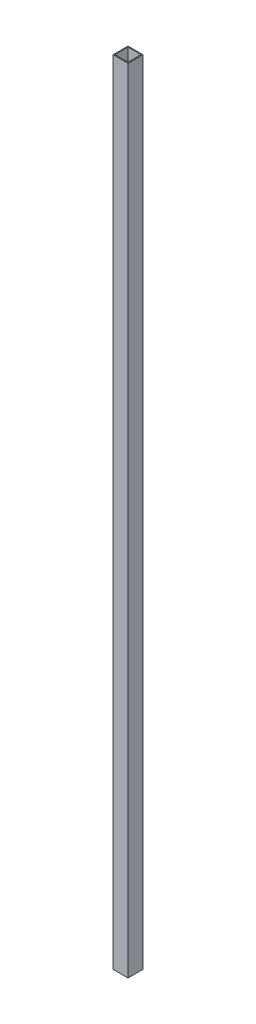
ISO-10303-21;
HEADER;
FILE_DESCRIPTION(('STEP AP214'),'2;1');
FILE_NAME('part.step','',(''),(''),'','','');
FILE_SCHEMA(('AUTOMOTIVE_DESIGN { 1 0 10303 214 1 1 1 1 }'));
ENDSEC;
DATA;
#1=APPLICATION_CONTEXT('core data for automotive mechanical design processes');
#2=APPLICATION_PROTOCOL_DEFINITION('international standard','automotive_design',2000,#1);
#3=PRODUCT_CONTEXT('',#1,'mechanical');
#4=PRODUCT('Part','Part','',(#3));
#5=PRODUCT_RELATED_PRODUCT_CATEGORY('part','',(#4));
#6=PRODUCT_DEFINITION_FORMATION('','',#4);
#7=PRODUCT_DEFINITION_CONTEXT('part definition',#1,'design');
#8=PRODUCT_DEFINITION('design','',#6,#7);
#9=PRODUCT_DEFINITION_SHAPE('','',#8);
#10=(LENGTH_UNIT() NAMED_UNIT(*) SI_UNIT(.MILLI.,.METRE.));
#11=(NAMED_UNIT(*) PLANE_ANGLE_UNIT() SI_UNIT($,.RADIAN.));
#12=(NAMED_UNIT(*) SI_UNIT($,.STERADIAN.) SOLID_ANGLE_UNIT());
#13=UNCERTAINTY_MEASURE_WITH_UNIT(LENGTH_MEASURE(1.E-05),#10,'distance_accuracy_value','');
#14=(GEOMETRIC_REPRESENTATION_CONTEXT(3) GLOBAL_UNCERTAINTY_ASSIGNED_CONTEXT((#13)) GLOBAL_UNIT_ASSIGNED_CONTEXT((#10,
#11,#12)) REPRESENTATION_CONTEXT('',''));
#15=CARTESIAN_POINT('',(0.,0.,0.));
#16=DIRECTION('',(0.,0.,1.));
#17=DIRECTION('',(1.,0.,0.));
#18=AXIS2_PLACEMENT_3D('',#15,#16,#17);
#19=CARTESIAN_POINT('',(0.,793.015,0.));
#20=DIRECTION('',(0.,1.,0.));
#21=DIRECTION('',(0.,0.,1.));
#22=AXIS2_PLACEMENT_3D('',#19,#20,#21);
#23=PLANE('',#22);
#24=DIRECTION('',(0.,0.,-1.));
#25=VECTOR('',#24,1.);
#26=CARTESIAN_POINT('',(15.,793.015,-15.));
#27=LINE('',#26,#25);
#28=CARTESIAN_POINT('',(15.,793.015,15.));
#29=VERTEX_POINT('',#28);
#30=CARTESIAN_POINT('',(15.,793.015,-15.));
#31=VERTEX_POINT('',#30);
#32=EDGE_CURVE('E153',#29,#31,#27,.T.);
#33=ORIENTED_EDGE('',*,*,#32,.T.);
#34=DIRECTION('',(-1.,0.,0.));
#35=VECTOR('',#34,1.);
#36=CARTESIAN_POINT('',(-15.,793.015,-15.));
#37=LINE('',#36,#35);
#38=CARTESIAN_POINT('',(-15.,793.015,-15.));
#39=VERTEX_POINT('',#38);
#40=EDGE_CURVE('E157',#31,#39,#37,.T.);
#41=ORIENTED_EDGE('',*,*,#40,.T.);
#42=DIRECTION('',(0.,0.,1.));
#43=VECTOR('',#42,1.);
#44=CARTESIAN_POINT('',(-15.,793.015,-15.));
#45=LINE('',#44,#43);
#46=CARTESIAN_POINT('',(-15.,793.015,15.));
#47=VERTEX_POINT('',#46);
#48=EDGE_CURVE('E161',#39,#47,#45,.T.);
#49=ORIENTED_EDGE('',*,*,#48,.T.);
#50=DIRECTION('',(1.,0.,0.));
#51=VECTOR('',#50,1.);
#52=CARTESIAN_POINT('',(-15.,793.015,15.));
#53=LINE('',#52,#51);
#54=EDGE_CURVE('E164',#47,#29,#53,.T.);
#55=ORIENTED_EDGE('',*,*,#54,.T.);
#56=EDGE_LOOP('',(#33,#41,#49,#55));
#57=FACE_BOUND('',#56,.T.);
#58=DIRECTION('',(0.,0.,1.));
#59=VECTOR('',#58,1.);
#60=CARTESIAN_POINT('',(-13.,793.015,-13.));
#61=LINE('',#60,#59);
#62=CARTESIAN_POINT('',(-13.,793.015,-13.));
#63=VERTEX_POINT('',#62);
#64=CARTESIAN_POINT('',(-13.,793.015,13.));
#65=VERTEX_POINT('',#64);
#66=EDGE_CURVE('E114',#63,#65,#61,.T.);
#67=ORIENTED_EDGE('',*,*,#66,.F.);
#68=DIRECTION('',(-1.,0.,0.));
#69=VECTOR('',#68,1.);
#70=CARTESIAN_POINT('',(-13.,793.015,-13.));
#71=LINE('',#70,#69);
#72=CARTESIAN_POINT('',(13.,793.015,-13.));
#73=VERTEX_POINT('',#72);
#74=EDGE_CURVE('E105',#73,#63,#71,.T.);
#75=ORIENTED_EDGE('',*,*,#74,.F.);
#76=DIRECTION('',(0.,0.,-1.));
#77=VECTOR('',#76,1.);
#78=CARTESIAN_POINT('',(13.,793.015,-13.));
#79=LINE('',#78,#77);
#80=CARTESIAN_POINT('',(13.,793.015,13.));
#81=VERTEX_POINT('',#80);
#82=EDGE_CURVE('E131',#81,#73,#79,.T.);
#83=ORIENTED_EDGE('',*,*,#82,.F.);
#84=DIRECTION('',(1.,0.,0.));
#85=VECTOR('',#84,1.);
#86=CARTESIAN_POINT('',(-13.,793.015,13.));
#87=LINE('',#86,#85);
#88=EDGE_CURVE('E127',#65,#81,#87,.T.);
#89=ORIENTED_EDGE('',*,*,#88,.F.);
#90=EDGE_LOOP('',(#67,#75,#83,#89));
#91=FACE_BOUND('',#90,.T.);
#92=ADVANCED_FACE('F39',(#57,#91),#23,.T.);
#93=CARTESIAN_POINT('',(0.,-793.015,0.));
#94=DIRECTION('',(0.,1.,0.));
#95=DIRECTION('',(0.,0.,1.));
#96=AXIS2_PLACEMENT_3D('',#93,#94,#95);
#97=PLANE('',#96);
#98=DIRECTION('',(0.,0.,-1.));
#99=VECTOR('',#98,1.);
#100=CARTESIAN_POINT('',(15.,-793.015,-15.));
#101=LINE('',#100,#99);
#102=CARTESIAN_POINT('',(15.,-793.015,15.));
#103=VERTEX_POINT('',#102);
#104=CARTESIAN_POINT('',(15.,-793.015,-15.));
#105=VERTEX_POINT('',#104);
#106=EDGE_CURVE('E123',#103,#105,#101,.T.);
#107=ORIENTED_EDGE('',*,*,#106,.F.);
#108=DIRECTION('',(1.,0.,0.));
#109=VECTOR('',#108,1.);
#110=CARTESIAN_POINT('',(-15.,-793.015,15.));
#111=LINE('',#110,#109);
#112=CARTESIAN_POINT('',(-15.,-793.015,15.));
#113=VERTEX_POINT('',#112);
#114=EDGE_CURVE('E158',#113,#103,#111,.T.);
#115=ORIENTED_EDGE('',*,*,#114,.F.);
#116=DIRECTION('',(0.,0.,1.));
#117=VECTOR('',#116,1.);
#118=CARTESIAN_POINT('',(-15.,-793.015,-15.));
#119=LINE('',#118,#117);
#120=CARTESIAN_POINT('',(-15.,-793.015,-15.));
#121=VERTEX_POINT('',#120);
#122=EDGE_CURVE('E174',#121,#113,#119,.T.);
#123=ORIENTED_EDGE('',*,*,#122,.F.);
#124=DIRECTION('',(-1.,0.,0.));
#125=VECTOR('',#124,1.);
#126=CARTESIAN_POINT('',(-15.,-793.015,-15.));
#127=LINE('',#126,#125);
#128=EDGE_CURVE('E171',#105,#121,#127,.T.);
#129=ORIENTED_EDGE('',*,*,#128,.F.);
#130=EDGE_LOOP('',(#107,#115,#123,#129));
#131=FACE_BOUND('',#130,.T.);
#132=DIRECTION('',(-1.,0.,0.));
#133=VECTOR('',#132,1.);
#134=CARTESIAN_POINT('',(-13.,-793.015,-13.));
#135=LINE('',#134,#133);
#136=CARTESIAN_POINT('',(13.,-793.015,-13.));
#137=VERTEX_POINT('',#136);
#138=CARTESIAN_POINT('',(-13.,-793.015,-13.));
#139=VERTEX_POINT('',#138);
#140=EDGE_CURVE('E63',#137,#139,#135,.T.);
#141=ORIENTED_EDGE('',*,*,#140,.T.);
#142=DIRECTION('',(0.,0.,1.));
#143=VECTOR('',#142,1.);
#144=CARTESIAN_POINT('',(-13.,-793.015,-13.));
#145=LINE('',#144,#143);
#146=CARTESIAN_POINT('',(-13.,-793.015,13.));
#147=VERTEX_POINT('',#146);
#148=EDGE_CURVE('E121',#139,#147,#145,.T.);
#149=ORIENTED_EDGE('',*,*,#148,.T.);
#150=DIRECTION('',(1.,0.,0.));
#151=VECTOR('',#150,1.);
#152=CARTESIAN_POINT('',(-13.,-793.015,13.));
#153=LINE('',#152,#151);
#154=CARTESIAN_POINT('',(13.,-793.015,13.));
#155=VERTEX_POINT('',#154);
#156=EDGE_CURVE('E140',#147,#155,#153,.T.);
#157=ORIENTED_EDGE('',*,*,#156,.T.);
#158=DIRECTION('',(0.,0.,-1.));
#159=VECTOR('',#158,1.);
#160=CARTESIAN_POINT('',(13.,-793.015,-13.));
#161=LINE('',#160,#159);
#162=EDGE_CURVE('E115',#155,#137,#161,.T.);
#163=ORIENTED_EDGE('',*,*,#162,.T.);
#164=EDGE_LOOP('',(#141,#149,#157,#163));
#165=FACE_BOUND('',#164,.T.);
#166=ADVANCED_FACE('F197',(#131,#165),#97,.F.);
#167=CARTESIAN_POINT('',(15.,793.015,-15.));
#168=DIRECTION('',(-1.,0.,0.));
#169=DIRECTION('',(0.,0.,1.));
#170=AXIS2_PLACEMENT_3D('',#167,#168,#169);
#171=PLANE('',#170);
#172=ORIENTED_EDGE('',*,*,#106,.T.);
#173=DIRECTION('',(0.,-1.,0.));
#174=VECTOR('',#173,1.);
#175=CARTESIAN_POINT('',(15.,793.015,-15.));
#176=LINE('',#175,#174);
#177=EDGE_CURVE('E11',#31,#105,#176,.T.);
#178=ORIENTED_EDGE('',*,*,#177,.F.);
#179=ORIENTED_EDGE('',*,*,#32,.F.);
#180=DIRECTION('',(0.,-1.,0.));
#181=VECTOR('',#180,1.);
#182=CARTESIAN_POINT('',(15.,793.015,15.));
#183=LINE('',#182,#181);
#184=EDGE_CURVE('E167',#29,#103,#183,.T.);
#185=ORIENTED_EDGE('',*,*,#184,.T.);
#186=EDGE_LOOP('',(#172,#178,#179,#185));
#187=FACE_BOUND('',#186,.T.);
#188=ADVANCED_FACE('F41',(#187),#171,.F.);
#189=CARTESIAN_POINT('',(-15.,793.015,-15.));
#190=DIRECTION('',(0.,0.,1.));
#191=DIRECTION('',(1.,0.,0.));
#192=AXIS2_PLACEMENT_3D('',#189,#190,#191);
#193=PLANE('',#192);
#194=ORIENTED_EDGE('',*,*,#128,.T.);
#195=DIRECTION('',(0.,-1.,0.));
#196=VECTOR('',#195,1.);
#197=CARTESIAN_POINT('',(-15.,793.015,-15.));
#198=LINE('',#197,#196);
#199=EDGE_CURVE('E48',#39,#121,#198,.T.);
#200=ORIENTED_EDGE('',*,*,#199,.F.);
#201=ORIENTED_EDGE('',*,*,#40,.F.);
#202=ORIENTED_EDGE('',*,*,#177,.T.);
#203=EDGE_LOOP('',(#194,#200,#201,#202));
#204=FACE_BOUND('',#203,.T.);
#205=ADVANCED_FACE('F207',(#204),#193,.F.);
#206=CARTESIAN_POINT('',(-15.,793.015,-15.));
#207=DIRECTION('',(1.,0.,0.));
#208=DIRECTION('',(0.,0.,-1.));
#209=AXIS2_PLACEMENT_3D('',#206,#207,#208);
#210=PLANE('',#209);
#211=ORIENTED_EDGE('',*,*,#122,.T.);
#212=DIRECTION('',(0.,-1.,0.));
#213=VECTOR('',#212,1.);
#214=CARTESIAN_POINT('',(-15.,793.015,15.));
#215=LINE('',#214,#213);
#216=EDGE_CURVE('E182',#47,#113,#215,.T.);
#217=ORIENTED_EDGE('',*,*,#216,.F.);
#218=ORIENTED_EDGE('',*,*,#48,.F.);
#219=ORIENTED_EDGE('',*,*,#199,.T.);
#220=EDGE_LOOP('',(#211,#217,#218,#219));
#221=FACE_BOUND('',#220,.T.);
#222=ADVANCED_FACE('F191',(#221),#210,.F.);
#223=CARTESIAN_POINT('',(-15.,793.015,15.));
#224=DIRECTION('',(0.,0.,-1.));
#225=DIRECTION('',(-1.,0.,0.));
#226=AXIS2_PLACEMENT_3D('',#223,#224,#225);
#227=PLANE('',#226);
#228=ORIENTED_EDGE('',*,*,#114,.T.);
#229=ORIENTED_EDGE('',*,*,#184,.F.);
#230=ORIENTED_EDGE('',*,*,#54,.F.);
#231=ORIENTED_EDGE('',*,*,#216,.T.);
#232=EDGE_LOOP('',(#228,#229,#230,#231));
#233=FACE_BOUND('',#232,.T.);
#234=ADVANCED_FACE('F201',(#233),#227,.F.);
#235=CARTESIAN_POINT('',(-13.,793.015,-13.));
#236=DIRECTION('',(0.,0.,1.));
#237=DIRECTION('',(1.,0.,0.));
#238=AXIS2_PLACEMENT_3D('',#235,#236,#237);
#239=PLANE('',#238);
#240=ORIENTED_EDGE('',*,*,#140,.F.);
#241=DIRECTION('',(0.,-1.,0.));
#242=VECTOR('',#241,1.);
#243=CARTESIAN_POINT('',(13.,793.015,-13.));
#244=LINE('',#243,#242);
#245=EDGE_CURVE('E109',#73,#137,#244,.T.);
#246=ORIENTED_EDGE('',*,*,#245,.F.);
#247=ORIENTED_EDGE('',*,*,#74,.T.);
#248=DIRECTION('',(0.,-1.,0.));
#249=VECTOR('',#248,1.);
#250=CARTESIAN_POINT('',(-13.,793.015,-13.));
#251=LINE('',#250,#249);
#252=EDGE_CURVE('E108',#63,#139,#251,.T.);
#253=ORIENTED_EDGE('',*,*,#252,.T.);
#254=EDGE_LOOP('',(#240,#246,#247,#253));
#255=FACE_BOUND('',#254,.T.);
#256=ADVANCED_FACE('F107',(#255),#239,.T.);
#257=CARTESIAN_POINT('',(-13.,793.015,-13.));
#258=DIRECTION('',(1.,0.,0.));
#259=DIRECTION('',(0.,0.,-1.));
#260=AXIS2_PLACEMENT_3D('',#257,#258,#259);
#261=PLANE('',#260);
#262=ORIENTED_EDGE('',*,*,#148,.F.);
#263=ORIENTED_EDGE('',*,*,#252,.F.);
#264=ORIENTED_EDGE('',*,*,#66,.T.);
#265=DIRECTION('',(0.,-1.,0.));
#266=VECTOR('',#265,1.);
#267=CARTESIAN_POINT('',(-13.,793.015,13.));
#268=LINE('',#267,#266);
#269=EDGE_CURVE('E124',#65,#147,#268,.T.);
#270=ORIENTED_EDGE('',*,*,#269,.T.);
#271=EDGE_LOOP('',(#262,#263,#264,#270));
#272=FACE_BOUND('',#271,.T.);
#273=ADVANCED_FACE('F118',(#272),#261,.T.);
#274=CARTESIAN_POINT('',(-13.,793.015,13.));
#275=DIRECTION('',(0.,0.,-1.));
#276=DIRECTION('',(-1.,0.,0.));
#277=AXIS2_PLACEMENT_3D('',#274,#275,#276);
#278=PLANE('',#277);
#279=ORIENTED_EDGE('',*,*,#156,.F.);
#280=ORIENTED_EDGE('',*,*,#269,.F.);
#281=ORIENTED_EDGE('',*,*,#88,.T.);
#282=DIRECTION('',(0.,-1.,0.));
#283=VECTOR('',#282,1.);
#284=CARTESIAN_POINT('',(13.,793.015,13.));
#285=LINE('',#284,#283);
#286=EDGE_CURVE('E55',#81,#155,#285,.T.);
#287=ORIENTED_EDGE('',*,*,#286,.T.);
#288=EDGE_LOOP('',(#279,#280,#281,#287));
#289=FACE_BOUND('',#288,.T.);
#290=ADVANCED_FACE('F230',(#289),#278,.T.);
#291=CARTESIAN_POINT('',(13.,793.015,-13.));
#292=DIRECTION('',(-1.,0.,0.));
#293=DIRECTION('',(0.,0.,1.));
#294=AXIS2_PLACEMENT_3D('',#291,#292,#293);
#295=PLANE('',#294);
#296=ORIENTED_EDGE('',*,*,#162,.F.);
#297=ORIENTED_EDGE('',*,*,#286,.F.);
#298=ORIENTED_EDGE('',*,*,#82,.T.);
#299=ORIENTED_EDGE('',*,*,#245,.T.);
#300=EDGE_LOOP('',(#296,#297,#298,#299));
#301=FACE_BOUND('',#300,.T.);
#302=ADVANCED_FACE('F234',(#301),#295,.T.);
#303=CLOSED_SHELL('',(#92,#166,#188,#205,#222,#234,#256,#273,#290,#302));
#304=MANIFOLD_SOLID_BREP('B2',#303);
#305=ADVANCED_BREP_SHAPE_REPRESENTATION('',(#18,#304),#14);
#306=SHAPE_DEFINITION_REPRESENTATION(#9,#305);
ENDSEC;
END-ISO-10303-21;
